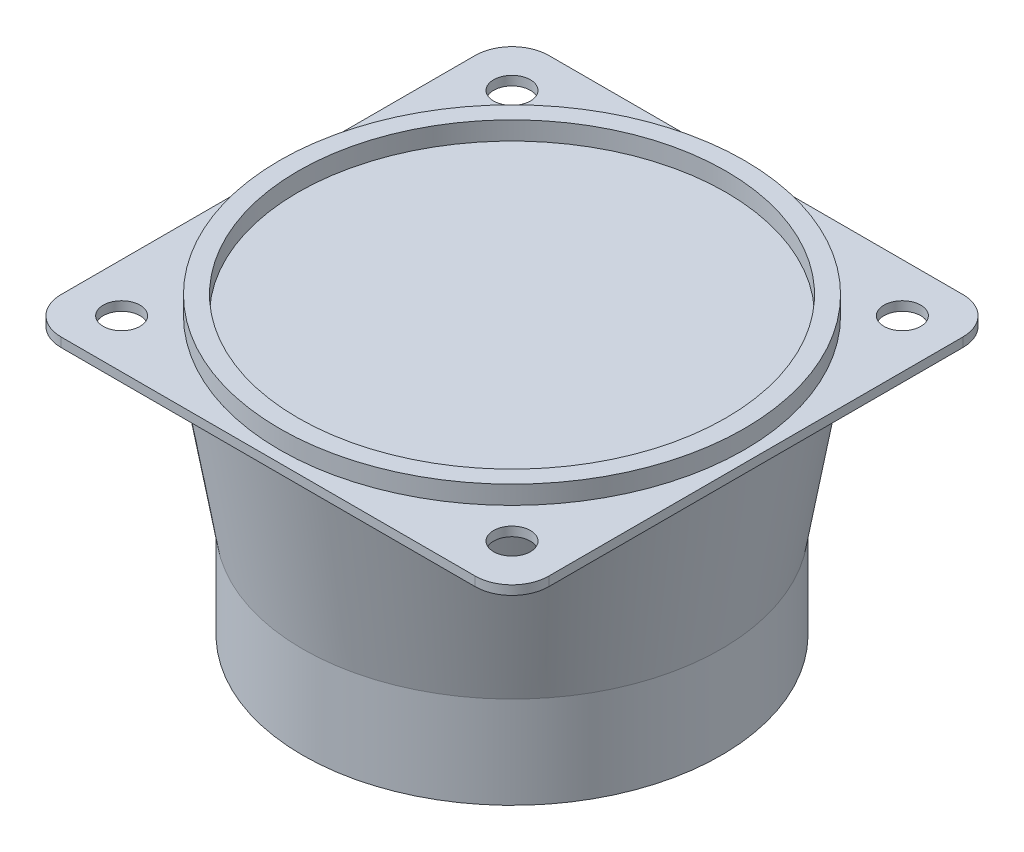
ISO-10303-21;
HEADER;
FILE_DESCRIPTION(('STEP AP214'),'2;1');
FILE_NAME('part.step','',(''),(''),'','','');
FILE_SCHEMA(('AUTOMOTIVE_DESIGN { 1 0 10303 214 1 1 1 1 }'));
ENDSEC;
DATA;
#1=APPLICATION_CONTEXT('core data for automotive mechanical design processes');
#2=APPLICATION_PROTOCOL_DEFINITION('international standard','automotive_design',2000,#1);
#3=PRODUCT_CONTEXT('',#1,'mechanical');
#4=PRODUCT('Part','Part','',(#3));
#5=PRODUCT_RELATED_PRODUCT_CATEGORY('part','',(#4));
#6=PRODUCT_DEFINITION_FORMATION('','',#4);
#7=PRODUCT_DEFINITION_CONTEXT('part definition',#1,'design');
#8=PRODUCT_DEFINITION('design','',#6,#7);
#9=PRODUCT_DEFINITION_SHAPE('','',#8);
#10=(LENGTH_UNIT() NAMED_UNIT(*) SI_UNIT(.MILLI.,.METRE.));
#11=(NAMED_UNIT(*) PLANE_ANGLE_UNIT() SI_UNIT($,.RADIAN.));
#12=(NAMED_UNIT(*) SI_UNIT($,.STERADIAN.) SOLID_ANGLE_UNIT());
#13=UNCERTAINTY_MEASURE_WITH_UNIT(LENGTH_MEASURE(1.E-05),#10,'distance_accuracy_value','');
#14=(GEOMETRIC_REPRESENTATION_CONTEXT(3) GLOBAL_UNCERTAINTY_ASSIGNED_CONTEXT((#13)) GLOBAL_UNIT_ASSIGNED_CONTEXT((#10,
#11,#12)) REPRESENTATION_CONTEXT('',''));
#15=CARTESIAN_POINT('',(0.,0.,0.));
#16=DIRECTION('',(0.,0.,1.));
#17=DIRECTION('',(1.,0.,0.));
#18=AXIS2_PLACEMENT_3D('',#15,#16,#17);
#19=CARTESIAN_POINT('',(0.,-1.,0.));
#20=DIRECTION('',(0.,-1.,0.));
#21=DIRECTION('',(0.,0.,-1.));
#22=AXIS2_PLACEMENT_3D('',#19,#20,#21);
#23=PLANE('',#22);
#24=CARTESIAN_POINT('',(21.2132034355964,-0.999999999999999,21.2132034355964));
#25=DIRECTION('',(0.,-1.,0.));
#26=DIRECTION('',(0.,0.,-1.));
#27=AXIS2_PLACEMENT_3D('',#24,#25,#26);
#28=CIRCLE('',#27,2.);
#29=CARTESIAN_POINT('',(21.2132034355964,-0.999999999999999,19.2132034355964));
#30=VERTEX_POINT('',#29);
#31=EDGE_CURVE('E198',#30,#30,#28,.T.);
#32=ORIENTED_EDGE('',*,*,#31,.F.);
#33=EDGE_LOOP('',(#32));
#34=FACE_BOUND('',#33,.T.);
#35=CARTESIAN_POINT('',(-21.2132034355964,-0.999999999999999,-21.2132034355964));
#36=DIRECTION('',(0.,-1.,0.));
#37=DIRECTION('',(0.,0.,-1.));
#38=AXIS2_PLACEMENT_3D('',#35,#36,#37);
#39=CIRCLE('',#38,2.);
#40=CARTESIAN_POINT('',(-21.2132034355964,-0.999999999999999,-23.2132034355964));
#41=VERTEX_POINT('',#40);
#42=EDGE_CURVE('E202',#41,#41,#39,.T.);
#43=ORIENTED_EDGE('',*,*,#42,.F.);
#44=EDGE_LOOP('',(#43));
#45=FACE_BOUND('',#44,.T.);
#46=CARTESIAN_POINT('',(21.2132034355964,-0.999999999999999,-21.2132034355964));
#47=DIRECTION('',(0.,-1.,0.));
#48=DIRECTION('',(0.,0.,-1.));
#49=AXIS2_PLACEMENT_3D('',#46,#47,#48);
#50=CIRCLE('',#49,2.);
#51=CARTESIAN_POINT('',(21.2132034355964,-0.999999999999999,-23.2132034355964));
#52=VERTEX_POINT('',#51);
#53=EDGE_CURVE('E447',#52,#52,#50,.T.);
#54=ORIENTED_EDGE('',*,*,#53,.F.);
#55=EDGE_LOOP('',(#54));
#56=FACE_BOUND('',#55,.T.);
#57=CARTESIAN_POINT('',(-21.2132034355964,-0.999999999999999,21.2132034355964));
#58=DIRECTION('',(0.,-1.,0.));
#59=DIRECTION('',(0.,0.,-1.));
#60=AXIS2_PLACEMENT_3D('',#57,#58,#59);
#61=CIRCLE('',#60,2.);
#62=CARTESIAN_POINT('',(-21.2132034355964,-0.999999999999999,19.2132034355964));
#63=VERTEX_POINT('',#62);
#64=EDGE_CURVE('E438',#63,#63,#61,.T.);
#65=ORIENTED_EDGE('',*,*,#64,.F.);
#66=EDGE_LOOP('',(#65));
#67=FACE_BOUND('',#66,.T.);
#68=DIRECTION('',(0.,0.,1.));
#69=VECTOR('',#68,1.);
#70=CARTESIAN_POINT('',(26.5,-1.,26.5));
#71=LINE('',#70,#69);
#72=CARTESIAN_POINT('',(26.5,-1.,-22.5));
#73=VERTEX_POINT('',#72);
#74=CARTESIAN_POINT('',(26.5,-1.,22.5));
#75=VERTEX_POINT('',#74);
#76=EDGE_CURVE('E152',#73,#75,#71,.T.);
#77=ORIENTED_EDGE('',*,*,#76,.T.);
#78=CARTESIAN_POINT('',(22.5,-1.,22.5));
#79=DIRECTION('',(0.,-1.,0.));
#80=DIRECTION('',(0.,0.,-1.));
#81=AXIS2_PLACEMENT_3D('',#78,#79,#80);
#82=CIRCLE('',#81,4.);
#83=CARTESIAN_POINT('',(22.5,-1.,26.5));
#84=VERTEX_POINT('',#83);
#85=EDGE_CURVE('E179',#75,#84,#82,.T.);
#86=ORIENTED_EDGE('',*,*,#85,.T.);
#87=DIRECTION('',(-1.,0.,0.));
#88=VECTOR('',#87,1.);
#89=CARTESIAN_POINT('',(-26.5,-1.,26.5));
#90=LINE('',#89,#88);
#91=CARTESIAN_POINT('',(-22.5,-1.,26.5));
#92=VERTEX_POINT('',#91);
#93=EDGE_CURVE('E135',#84,#92,#90,.T.);
#94=ORIENTED_EDGE('',*,*,#93,.T.);
#95=CARTESIAN_POINT('',(-22.5,-1.,22.5));
#96=DIRECTION('',(0.,-1.,0.));
#97=DIRECTION('',(0.,0.,-1.));
#98=AXIS2_PLACEMENT_3D('',#95,#96,#97);
#99=CIRCLE('',#98,4.);
#100=CARTESIAN_POINT('',(-26.5,-1.,22.5));
#101=VERTEX_POINT('',#100);
#102=EDGE_CURVE('E174',#92,#101,#99,.T.);
#103=ORIENTED_EDGE('',*,*,#102,.T.);
#104=DIRECTION('',(0.,0.,-1.));
#105=VECTOR('',#104,1.);
#106=CARTESIAN_POINT('',(-26.5,-1.,26.5));
#107=LINE('',#106,#105);
#108=CARTESIAN_POINT('',(-26.5,-1.,-22.5));
#109=VERTEX_POINT('',#108);
#110=EDGE_CURVE('E273',#101,#109,#107,.T.);
#111=ORIENTED_EDGE('',*,*,#110,.T.);
#112=CARTESIAN_POINT('',(-22.5,-1.,-22.5));
#113=DIRECTION('',(0.,-1.,0.));
#114=DIRECTION('',(0.,0.,-1.));
#115=AXIS2_PLACEMENT_3D('',#112,#113,#114);
#116=CIRCLE('',#115,4.);
#117=CARTESIAN_POINT('',(-22.5,-1.,-26.5));
#118=VERTEX_POINT('',#117);
#119=EDGE_CURVE('E71',#109,#118,#116,.T.);
#120=ORIENTED_EDGE('',*,*,#119,.T.);
#121=DIRECTION('',(1.,0.,0.));
#122=VECTOR('',#121,1.);
#123=CARTESIAN_POINT('',(-26.5,-1.,-26.5));
#124=LINE('',#123,#122);
#125=CARTESIAN_POINT('',(22.5,-1.,-26.5));
#126=VERTEX_POINT('',#125);
#127=EDGE_CURVE('E165',#118,#126,#124,.T.);
#128=ORIENTED_EDGE('',*,*,#127,.T.);
#129=CARTESIAN_POINT('',(22.5,-1.,-22.5));
#130=DIRECTION('',(0.,-1.,0.));
#131=DIRECTION('',(0.,0.,-1.));
#132=AXIS2_PLACEMENT_3D('',#129,#130,#131);
#133=CIRCLE('',#132,4.);
#134=EDGE_CURVE('E177',#126,#73,#133,.T.);
#135=ORIENTED_EDGE('',*,*,#134,.T.);
#136=EDGE_LOOP('',(#77,#86,#94,#103,#111,#120,#128,#135));
#137=FACE_BOUND('',#136,.T.);
#138=CARTESIAN_POINT('',(0.,-1.,0.));
#139=DIRECTION('',(0.,-1.,0.));
#140=DIRECTION('',(0.,0.,-1.));
#141=AXIS2_PLACEMENT_3D('',#138,#139,#140);
#142=CIRCLE('',#141,26.);
#143=CARTESIAN_POINT('',(0.,-1.,-26.));
#144=VERTEX_POINT('',#143);
#145=EDGE_CURVE('E147',#144,#144,#142,.T.);
#146=ORIENTED_EDGE('',*,*,#145,.F.);
#147=EDGE_LOOP('',(#146));
#148=FACE_BOUND('',#147,.T.);
#149=ADVANCED_FACE('F45',(#34,#45,#56,#67,#137,#148),#23,.T.);
#150=CARTESIAN_POINT('',(0.,2.,0.));
#151=DIRECTION('',(0.,1.,0.));
#152=DIRECTION('',(0.,0.,1.));
#153=AXIS2_PLACEMENT_3D('',#150,#151,#152);
#154=PLANE('',#153);
#155=CARTESIAN_POINT('',(0.,2.,0.));
#156=DIRECTION('',(0.,1.,0.));
#157=DIRECTION('',(0.,0.,1.));
#158=AXIS2_PLACEMENT_3D('',#155,#156,#157);
#159=CIRCLE('',#158,25.25);
#160=CARTESIAN_POINT('',(0.,2.,25.25));
#161=VERTEX_POINT('',#160);
#162=EDGE_CURVE('E156',#161,#161,#159,.T.);
#163=ORIENTED_EDGE('',*,*,#162,.T.);
#164=EDGE_LOOP('',(#163));
#165=FACE_BOUND('',#164,.T.);
#166=CARTESIAN_POINT('',(0.,2.,0.));
#167=DIRECTION('',(0.,1.,0.));
#168=DIRECTION('',(1.,0.,0.));
#169=AXIS2_PLACEMENT_3D('',#166,#167,#168);
#170=CIRCLE('',#169,23.25);
#171=CARTESIAN_POINT('',(23.25,2.,0.));
#172=VERTEX_POINT('',#171);
#173=EDGE_CURVE('E153',#172,#172,#170,.T.);
#174=ORIENTED_EDGE('',*,*,#173,.F.);
#175=EDGE_LOOP('',(#174));
#176=FACE_BOUND('',#175,.T.);
#177=ADVANCED_FACE('F224',(#165,#176),#154,.T.);
#178=CARTESIAN_POINT('',(0.,2.,0.));
#179=DIRECTION('',(0.,-1.,0.));
#180=DIRECTION('',(0.,0.,-1.));
#181=AXIS2_PLACEMENT_3D('',#178,#179,#180);
#182=CYLINDRICAL_SURFACE('',#181,25.25);
#183=ORIENTED_EDGE('',*,*,#162,.F.);
#184=EDGE_LOOP('',(#183));
#185=FACE_BOUND('',#184,.T.);
#186=CARTESIAN_POINT('',(0.,0.,0.));
#187=DIRECTION('',(0.,1.,0.));
#188=DIRECTION('',(0.,0.,1.));
#189=AXIS2_PLACEMENT_3D('',#186,#187,#188);
#190=CIRCLE('',#189,25.25);
#191=CARTESIAN_POINT('',(0.,0.,25.25));
#192=VERTEX_POINT('',#191);
#193=EDGE_CURVE('E160',#192,#192,#190,.T.);
#194=ORIENTED_EDGE('',*,*,#193,.T.);
#195=EDGE_LOOP('',(#194));
#196=FACE_BOUND('',#195,.T.);
#197=ADVANCED_FACE('F246',(#185,#196),#182,.T.);
#198=CARTESIAN_POINT('',(0.,2.,0.));
#199=DIRECTION('',(0.,-1.,0.));
#200=DIRECTION('',(0.,0.,-1.));
#201=AXIS2_PLACEMENT_3D('',#198,#199,#200);
#202=CYLINDRICAL_SURFACE('',#201,23.25);
#203=ORIENTED_EDGE('',*,*,#173,.T.);
#204=EDGE_LOOP('',(#203));
#205=FACE_BOUND('',#204,.T.);
#206=CARTESIAN_POINT('',(0.,0.,0.));
#207=DIRECTION('',(0.,1.,0.));
#208=DIRECTION('',(1.,0.,0.));
#209=AXIS2_PLACEMENT_3D('',#206,#207,#208);
#210=CIRCLE('',#209,23.25);
#211=CARTESIAN_POINT('',(23.25,0.,0.));
#212=VERTEX_POINT('',#211);
#213=EDGE_CURVE('E157',#212,#212,#210,.T.);
#214=ORIENTED_EDGE('',*,*,#213,.F.);
#215=EDGE_LOOP('',(#214));
#216=FACE_BOUND('',#215,.T.);
#217=ADVANCED_FACE('F243',(#205,#216),#202,.F.);
#218=CARTESIAN_POINT('',(0.,0.,0.));
#219=DIRECTION('',(0.,-1.,0.));
#220=DIRECTION('',(0.,0.,-1.));
#221=AXIS2_PLACEMENT_3D('',#218,#219,#220);
#222=PLANE('',#221);
#223=ORIENTED_EDGE('',*,*,#213,.T.);
#224=EDGE_LOOP('',(#223));
#225=FACE_BOUND('',#224,.T.);
#226=ADVANCED_FACE('F230',(#225),#222,.F.);
#227=CARTESIAN_POINT('',(26.5,-1.,26.5));
#228=DIRECTION('',(-1.,0.,0.));
#229=DIRECTION('',(0.,0.,1.));
#230=AXIS2_PLACEMENT_3D('',#227,#228,#229);
#231=PLANE('',#230);
#232=DIRECTION('',(0.,0.,1.));
#233=VECTOR('',#232,1.);
#234=CARTESIAN_POINT('',(26.5,0.,26.5));
#235=LINE('',#234,#233);
#236=CARTESIAN_POINT('',(26.5,0.,-22.5));
#237=VERTEX_POINT('',#236);
#238=CARTESIAN_POINT('',(26.5,0.,22.5));
#239=VERTEX_POINT('',#238);
#240=EDGE_CURVE('E142',#237,#239,#235,.T.);
#241=ORIENTED_EDGE('',*,*,#240,.T.);
#242=DIRECTION('',(0.,1.,0.));
#243=VECTOR('',#242,1.);
#244=CARTESIAN_POINT('',(26.5,-1.,22.5));
#245=LINE('',#244,#243);
#246=EDGE_CURVE('E120',#239,#75,#245,.F.);
#247=ORIENTED_EDGE('',*,*,#246,.T.);
#248=ORIENTED_EDGE('',*,*,#76,.F.);
#249=DIRECTION('',(0.,1.,0.));
#250=VECTOR('',#249,1.);
#251=CARTESIAN_POINT('',(26.5,-1.,-22.5));
#252=LINE('',#251,#250);
#253=EDGE_CURVE('E125',#73,#237,#252,.T.);
#254=ORIENTED_EDGE('',*,*,#253,.T.);
#255=EDGE_LOOP('',(#241,#247,#248,#254));
#256=FACE_BOUND('',#255,.T.);
#257=ADVANCED_FACE('F239',(#256),#231,.F.);
#258=CARTESIAN_POINT('',(-26.5,-1.,26.5));
#259=DIRECTION('',(0.,0.,-1.));
#260=DIRECTION('',(-1.,0.,0.));
#261=AXIS2_PLACEMENT_3D('',#258,#259,#260);
#262=PLANE('',#261);
#263=ORIENTED_EDGE('',*,*,#93,.F.);
#264=DIRECTION('',(0.,1.,0.));
#265=VECTOR('',#264,1.);
#266=CARTESIAN_POINT('',(22.5,-1.,26.5));
#267=LINE('',#266,#265);
#268=CARTESIAN_POINT('',(22.5,0.,26.5));
#269=VERTEX_POINT('',#268);
#270=EDGE_CURVE('E119',#84,#269,#267,.T.);
#271=ORIENTED_EDGE('',*,*,#270,.T.);
#272=DIRECTION('',(-1.,0.,0.));
#273=VECTOR('',#272,1.);
#274=CARTESIAN_POINT('',(-26.5,0.,26.5));
#275=LINE('',#274,#273);
#276=CARTESIAN_POINT('',(-22.5,0.,26.5));
#277=VERTEX_POINT('',#276);
#278=EDGE_CURVE('E132',#269,#277,#275,.T.);
#279=ORIENTED_EDGE('',*,*,#278,.T.);
#280=DIRECTION('',(0.,1.,0.));
#281=VECTOR('',#280,1.);
#282=CARTESIAN_POINT('',(-22.5,-1.,26.5));
#283=LINE('',#282,#281);
#284=EDGE_CURVE('E137',#277,#92,#283,.F.);
#285=ORIENTED_EDGE('',*,*,#284,.T.);
#286=EDGE_LOOP('',(#263,#271,#279,#285));
#287=FACE_BOUND('',#286,.T.);
#288=ADVANCED_FACE('F131',(#287),#262,.F.);
#289=CARTESIAN_POINT('',(-26.5,-1.,26.5));
#290=DIRECTION('',(1.,0.,0.));
#291=DIRECTION('',(0.,0.,-1.));
#292=AXIS2_PLACEMENT_3D('',#289,#290,#291);
#293=PLANE('',#292);
#294=DIRECTION('',(0.,0.,-1.));
#295=VECTOR('',#294,1.);
#296=CARTESIAN_POINT('',(-26.5,0.,26.5));
#297=LINE('',#296,#295);
#298=CARTESIAN_POINT('',(-26.5,0.,22.5));
#299=VERTEX_POINT('',#298);
#300=CARTESIAN_POINT('',(-26.5,0.,-22.5));
#301=VERTEX_POINT('',#300);
#302=EDGE_CURVE('E141',#299,#301,#297,.T.);
#303=ORIENTED_EDGE('',*,*,#302,.T.);
#304=DIRECTION('',(0.,1.,0.));
#305=VECTOR('',#304,1.);
#306=CARTESIAN_POINT('',(-26.5,-1.,-22.5));
#307=LINE('',#306,#305);
#308=EDGE_CURVE('E12',#301,#109,#307,.F.);
#309=ORIENTED_EDGE('',*,*,#308,.T.);
#310=ORIENTED_EDGE('',*,*,#110,.F.);
#311=DIRECTION('',(0.,1.,0.));
#312=VECTOR('',#311,1.);
#313=CARTESIAN_POINT('',(-26.5,-1.,22.5));
#314=LINE('',#313,#312);
#315=EDGE_CURVE('E56',#101,#299,#314,.T.);
#316=ORIENTED_EDGE('',*,*,#315,.T.);
#317=EDGE_LOOP('',(#303,#309,#310,#316));
#318=FACE_BOUND('',#317,.T.);
#319=ADVANCED_FACE('F233',(#318),#293,.F.);
#320=CARTESIAN_POINT('',(-26.5,-1.,-26.5));
#321=DIRECTION('',(0.,0.,1.));
#322=DIRECTION('',(1.,0.,0.));
#323=AXIS2_PLACEMENT_3D('',#320,#321,#322);
#324=PLANE('',#323);
#325=DIRECTION('',(1.,0.,0.));
#326=VECTOR('',#325,1.);
#327=CARTESIAN_POINT('',(-26.5,0.,-26.5));
#328=LINE('',#327,#326);
#329=CARTESIAN_POINT('',(-22.5,0.,-26.5));
#330=VERTEX_POINT('',#329);
#331=CARTESIAN_POINT('',(22.5,0.,-26.5));
#332=VERTEX_POINT('',#331);
#333=EDGE_CURVE('E145',#330,#332,#328,.T.);
#334=ORIENTED_EDGE('',*,*,#333,.T.);
#335=DIRECTION('',(0.,1.,0.));
#336=VECTOR('',#335,1.);
#337=CARTESIAN_POINT('',(22.5,-1.,-26.5));
#338=LINE('',#337,#336);
#339=EDGE_CURVE('E64',#332,#126,#338,.F.);
#340=ORIENTED_EDGE('',*,*,#339,.T.);
#341=ORIENTED_EDGE('',*,*,#127,.F.);
#342=DIRECTION('',(0.,1.,0.));
#343=VECTOR('',#342,1.);
#344=CARTESIAN_POINT('',(-22.5,-1.,-26.5));
#345=LINE('',#344,#343);
#346=EDGE_CURVE('E181',#118,#330,#345,.T.);
#347=ORIENTED_EDGE('',*,*,#346,.T.);
#348=EDGE_LOOP('',(#334,#340,#341,#347));
#349=FACE_BOUND('',#348,.T.);
#350=ADVANCED_FACE('F228',(#349),#324,.F.);
#351=CARTESIAN_POINT('',(21.2132034355964,0.,21.2132034355964));
#352=DIRECTION('',(0.,1.,0.));
#353=DIRECTION('',(0.,0.,1.));
#354=AXIS2_PLACEMENT_3D('',#351,#352,#353);
#355=CIRCLE('',#354,2.);
#356=CARTESIAN_POINT('',(21.2132034355964,0.,23.2132034355964));
#357=VERTEX_POINT('',#356);
#358=EDGE_CURVE('E433',#357,#357,#355,.T.);
#359=ORIENTED_EDGE('',*,*,#358,.F.);
#360=EDGE_LOOP('',(#359));
#361=FACE_BOUND('',#360,.T.);
#362=CARTESIAN_POINT('',(-21.2132034355964,0.,-21.2132034355964));
#363=DIRECTION('',(0.,1.,0.));
#364=DIRECTION('',(0.,0.,1.));
#365=AXIS2_PLACEMENT_3D('',#362,#363,#364);
#366=CIRCLE('',#365,2.);
#367=CARTESIAN_POINT('',(-21.2132034355964,0.,-19.2132034355964));
#368=VERTEX_POINT('',#367);
#369=EDGE_CURVE('E435',#368,#368,#366,.T.);
#370=ORIENTED_EDGE('',*,*,#369,.F.);
#371=EDGE_LOOP('',(#370));
#372=FACE_BOUND('',#371,.T.);
#373=CARTESIAN_POINT('',(21.2132034355964,0.,-21.2132034355964));
#374=DIRECTION('',(0.,1.,0.));
#375=DIRECTION('',(0.,0.,1.));
#376=AXIS2_PLACEMENT_3D('',#373,#374,#375);
#377=CIRCLE('',#376,2.);
#378=CARTESIAN_POINT('',(21.2132034355964,0.,-19.2132034355964));
#379=VERTEX_POINT('',#378);
#380=EDGE_CURVE('E441',#379,#379,#377,.T.);
#381=ORIENTED_EDGE('',*,*,#380,.F.);
#382=EDGE_LOOP('',(#381));
#383=FACE_BOUND('',#382,.T.);
#384=CARTESIAN_POINT('',(-21.2132034355964,0.,21.2132034355964));
#385=DIRECTION('',(0.,1.,0.));
#386=DIRECTION('',(0.,0.,1.));
#387=AXIS2_PLACEMENT_3D('',#384,#385,#386);
#388=CIRCLE('',#387,2.);
#389=CARTESIAN_POINT('',(-21.2132034355964,0.,23.2132034355964));
#390=VERTEX_POINT('',#389);
#391=EDGE_CURVE('E434',#390,#390,#388,.T.);
#392=ORIENTED_EDGE('',*,*,#391,.F.);
#393=EDGE_LOOP('',(#392));
#394=FACE_BOUND('',#393,.T.);
#395=ORIENTED_EDGE('',*,*,#193,.F.);
#396=EDGE_LOOP('',(#395));
#397=FACE_BOUND('',#396,.T.);
#398=ORIENTED_EDGE('',*,*,#278,.F.);
#399=CARTESIAN_POINT('',(22.5,0.,22.5));
#400=DIRECTION('',(0.,-1.,0.));
#401=DIRECTION('',(0.,0.,-1.));
#402=AXIS2_PLACEMENT_3D('',#399,#400,#401);
#403=CIRCLE('',#402,4.);
#404=EDGE_CURVE('E115',#269,#239,#403,.F.);
#405=ORIENTED_EDGE('',*,*,#404,.T.);
#406=ORIENTED_EDGE('',*,*,#240,.F.);
#407=CARTESIAN_POINT('',(22.5,0.,-22.5));
#408=DIRECTION('',(0.,-1.,0.));
#409=DIRECTION('',(0.,0.,-1.));
#410=AXIS2_PLACEMENT_3D('',#407,#408,#409);
#411=CIRCLE('',#410,4.);
#412=EDGE_CURVE('E126',#237,#332,#411,.F.);
#413=ORIENTED_EDGE('',*,*,#412,.T.);
#414=ORIENTED_EDGE('',*,*,#333,.F.);
#415=CARTESIAN_POINT('',(-22.5,0.,-22.5));
#416=DIRECTION('',(0.,-1.,0.));
#417=DIRECTION('',(0.,0.,-1.));
#418=AXIS2_PLACEMENT_3D('',#415,#416,#417);
#419=CIRCLE('',#418,4.);
#420=EDGE_CURVE('E168',#330,#301,#419,.F.);
#421=ORIENTED_EDGE('',*,*,#420,.T.);
#422=ORIENTED_EDGE('',*,*,#302,.F.);
#423=CARTESIAN_POINT('',(-22.5,0.,22.5));
#424=DIRECTION('',(0.,-1.,0.));
#425=DIRECTION('',(0.,0.,-1.));
#426=AXIS2_PLACEMENT_3D('',#423,#424,#425);
#427=CIRCLE('',#426,4.);
#428=EDGE_CURVE('E136',#299,#277,#427,.F.);
#429=ORIENTED_EDGE('',*,*,#428,.T.);
#430=EDGE_LOOP('',(#398,#405,#406,#413,#414,#421,#422,#429));
#431=FACE_BOUND('',#430,.T.);
#432=ADVANCED_FACE('F139',(#361,#372,#383,#394,#397,#431),#222,.F.);
#433=CARTESIAN_POINT('',(22.5,-1.,22.5));
#434=DIRECTION('',(0.,1.,0.));
#435=DIRECTION('',(0.,0.,1.));
#436=AXIS2_PLACEMENT_3D('',#433,#434,#435);
#437=CYLINDRICAL_SURFACE('',#436,4.);
#438=ORIENTED_EDGE('',*,*,#85,.F.);
#439=ORIENTED_EDGE('',*,*,#246,.F.);
#440=ORIENTED_EDGE('',*,*,#404,.F.);
#441=ORIENTED_EDGE('',*,*,#270,.F.);
#442=EDGE_LOOP('',(#438,#439,#440,#441));
#443=FACE_BOUND('',#442,.T.);
#444=ADVANCED_FACE('F118',(#443),#437,.T.);
#445=CARTESIAN_POINT('',(22.5,-1.,-22.5));
#446=DIRECTION('',(0.,1.,0.));
#447=DIRECTION('',(0.,0.,1.));
#448=AXIS2_PLACEMENT_3D('',#445,#446,#447);
#449=CYLINDRICAL_SURFACE('',#448,4.);
#450=ORIENTED_EDGE('',*,*,#134,.F.);
#451=ORIENTED_EDGE('',*,*,#339,.F.);
#452=ORIENTED_EDGE('',*,*,#412,.F.);
#453=ORIENTED_EDGE('',*,*,#253,.F.);
#454=EDGE_LOOP('',(#450,#451,#452,#453));
#455=FACE_BOUND('',#454,.T.);
#456=ADVANCED_FACE('F256',(#455),#449,.T.);
#457=CARTESIAN_POINT('',(-22.5,-1.,-22.5));
#458=DIRECTION('',(0.,1.,0.));
#459=DIRECTION('',(0.,0.,1.));
#460=AXIS2_PLACEMENT_3D('',#457,#458,#459);
#461=CYLINDRICAL_SURFACE('',#460,4.);
#462=ORIENTED_EDGE('',*,*,#119,.F.);
#463=ORIENTED_EDGE('',*,*,#308,.F.);
#464=ORIENTED_EDGE('',*,*,#420,.F.);
#465=ORIENTED_EDGE('',*,*,#346,.F.);
#466=EDGE_LOOP('',(#462,#463,#464,#465));
#467=FACE_BOUND('',#466,.T.);
#468=ADVANCED_FACE('F258',(#467),#461,.T.);
#469=CARTESIAN_POINT('',(-22.5,-1.,22.5));
#470=DIRECTION('',(0.,1.,0.));
#471=DIRECTION('',(0.,0.,1.));
#472=AXIS2_PLACEMENT_3D('',#469,#470,#471);
#473=CYLINDRICAL_SURFACE('',#472,4.);
#474=ORIENTED_EDGE('',*,*,#102,.F.);
#475=ORIENTED_EDGE('',*,*,#284,.F.);
#476=ORIENTED_EDGE('',*,*,#428,.F.);
#477=ORIENTED_EDGE('',*,*,#315,.F.);
#478=EDGE_LOOP('',(#474,#475,#476,#477));
#479=FACE_BOUND('',#478,.T.);
#480=ADVANCED_FACE('F47',(#479),#473,.T.);
#481=CARTESIAN_POINT('',(0.,-20.,0.));
#482=DIRECTION('',(0.,1.,0.));
#483=DIRECTION('',(0.,0.,1.));
#484=AXIS2_PLACEMENT_3D('',#481,#482,#483);
#485=CONICAL_SURFACE('',#484,22.75,0.169413043889619);
#486=ORIENTED_EDGE('',*,*,#145,.T.);
#487=EDGE_LOOP('',(#486));
#488=FACE_BOUND('',#487,.T.);
#489=CARTESIAN_POINT('',(0.,-20.,0.));
#490=DIRECTION('',(0.,1.,0.));
#491=DIRECTION('',(0.,0.,1.));
#492=AXIS2_PLACEMENT_3D('',#489,#490,#491);
#493=CIRCLE('',#492,22.75);
#494=CARTESIAN_POINT('',(0.,-20.,22.75));
#495=VERTEX_POINT('',#494);
#496=EDGE_CURVE('E189',#495,#495,#493,.T.);
#497=ORIENTED_EDGE('',*,*,#496,.T.);
#498=EDGE_LOOP('',(#497));
#499=FACE_BOUND('',#498,.T.);
#500=ADVANCED_FACE('F210',(#488,#499),#485,.T.);
#501=CARTESIAN_POINT('',(0.,-20.,0.));
#502=DIRECTION('',(0.,-1.,0.));
#503=DIRECTION('',(0.,0.,-1.));
#504=AXIS2_PLACEMENT_3D('',#501,#502,#503);
#505=CYLINDRICAL_SURFACE('',#504,22.75);
#506=ORIENTED_EDGE('',*,*,#496,.F.);
#507=EDGE_LOOP('',(#506));
#508=FACE_BOUND('',#507,.T.);
#509=CARTESIAN_POINT('',(0.,-30.,0.));
#510=DIRECTION('',(0.,1.,0.));
#511=DIRECTION('',(0.,0.,1.));
#512=AXIS2_PLACEMENT_3D('',#509,#510,#511);
#513=CIRCLE('',#512,22.75);
#514=CARTESIAN_POINT('',(0.,-30.,22.75));
#515=VERTEX_POINT('',#514);
#516=EDGE_CURVE('E194',#515,#515,#513,.T.);
#517=ORIENTED_EDGE('',*,*,#516,.T.);
#518=EDGE_LOOP('',(#517));
#519=FACE_BOUND('',#518,.T.);
#520=ADVANCED_FACE('F190',(#508,#519),#505,.T.);
#521=CARTESIAN_POINT('',(0.,-30.,0.));
#522=DIRECTION('',(0.,1.,0.));
#523=DIRECTION('',(0.,0.,1.));
#524=AXIS2_PLACEMENT_3D('',#521,#522,#523);
#525=PLANE('',#524);
#526=ORIENTED_EDGE('',*,*,#516,.F.);
#527=EDGE_LOOP('',(#526));
#528=FACE_BOUND('',#527,.T.);
#529=ADVANCED_FACE('F293',(#528),#525,.F.);
#530=CARTESIAN_POINT('',(-21.2132034355964,-10.,21.2132034355964));
#531=DIRECTION('',(0.,1.,0.));
#532=DIRECTION('',(0.,0.,1.));
#533=AXIS2_PLACEMENT_3D('',#530,#531,#532);
#534=CYLINDRICAL_SURFACE('',#533,2.);
#535=ORIENTED_EDGE('',*,*,#64,.T.);
#536=EDGE_LOOP('',(#535));
#537=FACE_BOUND('',#536,.T.);
#538=ORIENTED_EDGE('',*,*,#391,.T.);
#539=EDGE_LOOP('',(#538));
#540=FACE_BOUND('',#539,.T.);
#541=ADVANCED_FACE('F299',(#537,#540),#534,.F.);
#542=CARTESIAN_POINT('',(21.2132034355964,-10.,-21.2132034355964));
#543=DIRECTION('',(0.,1.,0.));
#544=DIRECTION('',(0.,0.,1.));
#545=AXIS2_PLACEMENT_3D('',#542,#543,#544);
#546=CYLINDRICAL_SURFACE('',#545,2.);
#547=ORIENTED_EDGE('',*,*,#53,.T.);
#548=EDGE_LOOP('',(#547));
#549=FACE_BOUND('',#548,.T.);
#550=ORIENTED_EDGE('',*,*,#380,.T.);
#551=EDGE_LOOP('',(#550));
#552=FACE_BOUND('',#551,.T.);
#553=ADVANCED_FACE('F307',(#549,#552),#546,.F.);
#554=CARTESIAN_POINT('',(-21.2132034355964,-10.,-21.2132034355964));
#555=DIRECTION('',(0.,1.,0.));
#556=DIRECTION('',(0.,0.,1.));
#557=AXIS2_PLACEMENT_3D('',#554,#555,#556);
#558=CYLINDRICAL_SURFACE('',#557,2.);
#559=ORIENTED_EDGE('',*,*,#42,.T.);
#560=EDGE_LOOP('',(#559));
#561=FACE_BOUND('',#560,.T.);
#562=ORIENTED_EDGE('',*,*,#369,.T.);
#563=EDGE_LOOP('',(#562));
#564=FACE_BOUND('',#563,.T.);
#565=ADVANCED_FACE('F316',(#561,#564),#558,.F.);
#566=CARTESIAN_POINT('',(21.2132034355964,-10.,21.2132034355964));
#567=DIRECTION('',(0.,1.,0.));
#568=DIRECTION('',(0.,0.,1.));
#569=AXIS2_PLACEMENT_3D('',#566,#567,#568);
#570=CYLINDRICAL_SURFACE('',#569,2.);
#571=ORIENTED_EDGE('',*,*,#31,.T.);
#572=EDGE_LOOP('',(#571));
#573=FACE_BOUND('',#572,.T.);
#574=ORIENTED_EDGE('',*,*,#358,.T.);
#575=EDGE_LOOP('',(#574));
#576=FACE_BOUND('',#575,.T.);
#577=ADVANCED_FACE('F324',(#573,#576),#570,.F.);
#578=CLOSED_SHELL('',(#149,#177,#197,#217,#226,#257,#288,#319,#350,#432,#444,#456,#468,#480,
#500,#520,#529,#541,#553,#565,#577));
#579=MANIFOLD_SOLID_BREP('B2',#578);
#580=ADVANCED_BREP_SHAPE_REPRESENTATION('',(#18,#579),#14);
#581=SHAPE_DEFINITION_REPRESENTATION(#9,#580);
ENDSEC;
END-ISO-10303-21;
